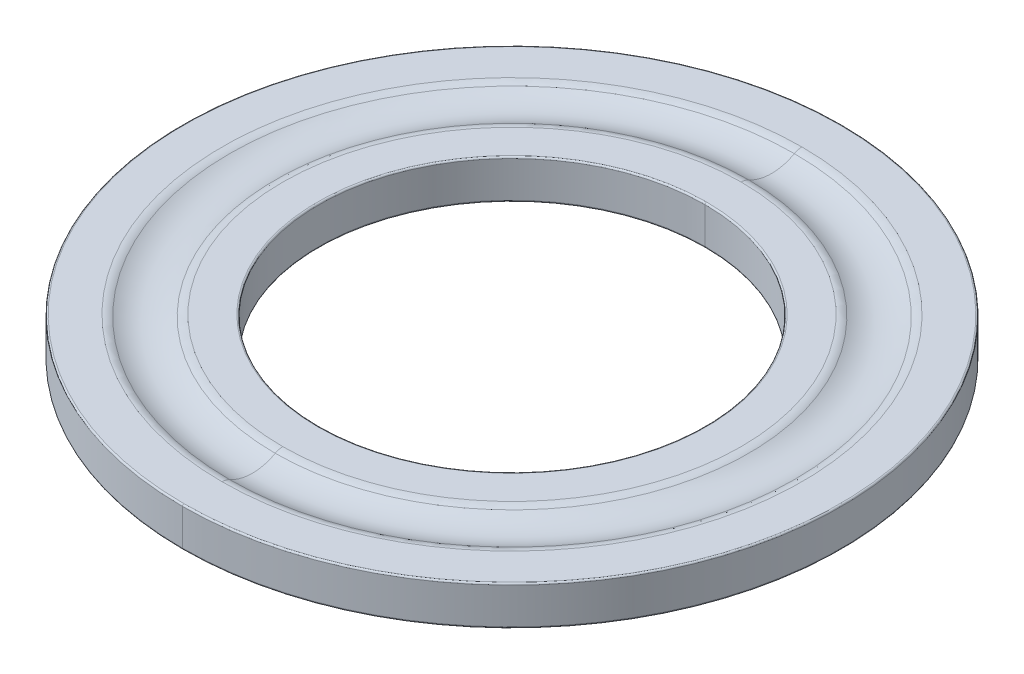
ISO-10303-21;
HEADER;
FILE_DESCRIPTION(('STEP AP214'),'2;1');
FILE_NAME('part.step','',(''),(''),'','','');
FILE_SCHEMA(('AUTOMOTIVE_DESIGN { 1 0 10303 214 1 1 1 1 }'));
ENDSEC;
DATA;
#1=APPLICATION_CONTEXT('core data for automotive mechanical design processes');
#2=APPLICATION_PROTOCOL_DEFINITION('international standard','automotive_design',2000,#1);
#3=PRODUCT_CONTEXT('',#1,'mechanical');
#4=PRODUCT('Part','Part','',(#3));
#5=PRODUCT_RELATED_PRODUCT_CATEGORY('part','',(#4));
#6=PRODUCT_DEFINITION_FORMATION('','',#4);
#7=PRODUCT_DEFINITION_CONTEXT('part definition',#1,'design');
#8=PRODUCT_DEFINITION('design','',#6,#7);
#9=PRODUCT_DEFINITION_SHAPE('','',#8);
#10=(LENGTH_UNIT() NAMED_UNIT(*) SI_UNIT(.MILLI.,.METRE.));
#11=(NAMED_UNIT(*) PLANE_ANGLE_UNIT() SI_UNIT($,.RADIAN.));
#12=(NAMED_UNIT(*) SI_UNIT($,.STERADIAN.) SOLID_ANGLE_UNIT());
#13=UNCERTAINTY_MEASURE_WITH_UNIT(LENGTH_MEASURE(1.E-05),#10,'distance_accuracy_value','');
#14=(GEOMETRIC_REPRESENTATION_CONTEXT(3) GLOBAL_UNCERTAINTY_ASSIGNED_CONTEXT((#13)) GLOBAL_UNIT_ASSIGNED_CONTEXT((#10,
#11,#12)) REPRESENTATION_CONTEXT('',''));
#15=CARTESIAN_POINT('',(0.,0.,0.));
#16=DIRECTION('',(0.,0.,1.));
#17=DIRECTION('',(1.,0.,0.));
#18=AXIS2_PLACEMENT_3D('',#15,#16,#17);
#19=CARTESIAN_POINT('',(0.,1.2,0.));
#20=DIRECTION('',(0.,1.,0.));
#21=DIRECTION('',(0.,0.,1.));
#22=AXIS2_PLACEMENT_3D('',#19,#20,#21);
#23=TOROIDAL_SURFACE('',#22,10.45,0.05);
#24=CARTESIAN_POINT('',(0.,1.2,-10.45));
#25=DIRECTION('',(1.,0.,0.));
#26=DIRECTION('',(0.,0.,-1.));
#27=AXIS2_PLACEMENT_3D('',#24,#25,#26);
#28=CIRCLE('',#27,0.05);
#29=CARTESIAN_POINT('',(0.,1.2,-10.5));
#30=VERTEX_POINT('',#29);
#31=CARTESIAN_POINT('',(0.,1.25,-10.45));
#32=VERTEX_POINT('',#31);
#33=EDGE_CURVE('E274',#30,#32,#28,.T.);
#34=ORIENTED_EDGE('',*,*,#33,.F.);
#35=CARTESIAN_POINT('',(0.,1.2,0.));
#36=DIRECTION('',(0.,-1.,0.));
#37=DIRECTION('',(0.,0.,1.));
#38=AXIS2_PLACEMENT_3D('',#35,#36,#37);
#39=CIRCLE('',#38,10.5);
#40=CARTESIAN_POINT('',(0.,1.2,10.5));
#41=VERTEX_POINT('',#40);
#42=EDGE_CURVE('E25',#41,#30,#39,.T.);
#43=ORIENTED_EDGE('',*,*,#42,.F.);
#44=CARTESIAN_POINT('',(0.,1.2,10.45));
#45=DIRECTION('',(-1.,0.,0.));
#46=DIRECTION('',(0.,0.,1.));
#47=AXIS2_PLACEMENT_3D('',#44,#45,#46);
#48=CIRCLE('',#47,0.05);
#49=CARTESIAN_POINT('',(0.,1.25,10.45));
#50=VERTEX_POINT('',#49);
#51=EDGE_CURVE('E282',#41,#50,#48,.T.);
#52=ORIENTED_EDGE('',*,*,#51,.T.);
#53=CARTESIAN_POINT('',(0.,1.25,0.));
#54=DIRECTION('',(0.,1.,0.));
#55=DIRECTION('',(0.,0.,1.));
#56=AXIS2_PLACEMENT_3D('',#53,#54,#55);
#57=CIRCLE('',#56,10.45);
#58=EDGE_CURVE('E245',#32,#50,#57,.T.);
#59=ORIENTED_EDGE('',*,*,#58,.F.);
#60=EDGE_LOOP('',(#34,#43,#52,#59));
#61=FACE_BOUND('',#60,.T.);
#62=ADVANCED_FACE('F16',(#61),#23,.T.);
#63=CARTESIAN_POINT('',(0.,0.05,0.));
#64=DIRECTION('',(0.,1.,0.));
#65=DIRECTION('',(0.,0.,1.));
#66=AXIS2_PLACEMENT_3D('',#63,#64,#65);
#67=TOROIDAL_SURFACE('',#66,10.45,0.05);
#68=CARTESIAN_POINT('',(0.,0.05,-10.45));
#69=DIRECTION('',(1.,0.,0.));
#70=DIRECTION('',(0.,0.,-1.));
#71=AXIS2_PLACEMENT_3D('',#68,#69,#70);
#72=CIRCLE('',#71,0.05);
#73=CARTESIAN_POINT('',(0.,0.,-10.45));
#74=VERTEX_POINT('',#73);
#75=CARTESIAN_POINT('',(0.,0.05,-10.5));
#76=VERTEX_POINT('',#75);
#77=EDGE_CURVE('E296',#74,#76,#72,.T.);
#78=ORIENTED_EDGE('',*,*,#77,.F.);
#79=CARTESIAN_POINT('',(0.,0.,0.));
#80=DIRECTION('',(0.,-1.,0.));
#81=DIRECTION('',(0.,0.,1.));
#82=AXIS2_PLACEMENT_3D('',#79,#80,#81);
#83=CIRCLE('',#82,10.45);
#84=CARTESIAN_POINT('',(0.,0.,10.45));
#85=VERTEX_POINT('',#84);
#86=EDGE_CURVE('E235',#85,#74,#83,.T.);
#87=ORIENTED_EDGE('',*,*,#86,.F.);
#88=CARTESIAN_POINT('',(0.,0.05,10.45));
#89=DIRECTION('',(-1.,0.,0.));
#90=DIRECTION('',(0.,0.,1.));
#91=AXIS2_PLACEMENT_3D('',#88,#89,#90);
#92=CIRCLE('',#91,0.05);
#93=CARTESIAN_POINT('',(0.,0.05,10.5));
#94=VERTEX_POINT('',#93);
#95=EDGE_CURVE('E179',#85,#94,#92,.T.);
#96=ORIENTED_EDGE('',*,*,#95,.T.);
#97=CARTESIAN_POINT('',(0.,0.05,0.));
#98=DIRECTION('',(0.,1.,0.));
#99=DIRECTION('',(0.,0.,1.));
#100=AXIS2_PLACEMENT_3D('',#97,#98,#99);
#101=CIRCLE('',#100,10.5);
#102=EDGE_CURVE('E10',#76,#94,#101,.T.);
#103=ORIENTED_EDGE('',*,*,#102,.F.);
#104=EDGE_LOOP('',(#78,#87,#96,#103));
#105=FACE_BOUND('',#104,.T.);
#106=ADVANCED_FACE('F18',(#105),#67,.T.);
#107=CARTESIAN_POINT('',(0.,1.2,0.));
#108=DIRECTION('',(0.,1.,0.));
#109=DIRECTION('',(0.,0.,1.));
#110=AXIS2_PLACEMENT_3D('',#107,#108,#109);
#111=TOROIDAL_SURFACE('',#110,6.2,0.05);
#112=CARTESIAN_POINT('',(0.,1.2,-6.2));
#113=DIRECTION('',(1.,0.,0.));
#114=DIRECTION('',(0.,0.,-1.));
#115=AXIS2_PLACEMENT_3D('',#112,#113,#114);
#116=CIRCLE('',#115,0.05);
#117=CARTESIAN_POINT('',(0.,1.25,-6.2));
#118=VERTEX_POINT('',#117);
#119=CARTESIAN_POINT('',(0.,1.2,-6.15));
#120=VERTEX_POINT('',#119);
#121=EDGE_CURVE('E158',#118,#120,#116,.T.);
#122=ORIENTED_EDGE('',*,*,#121,.F.);
#123=CARTESIAN_POINT('',(0.,1.25,0.));
#124=DIRECTION('',(0.,-1.,0.));
#125=DIRECTION('',(0.,0.,1.));
#126=AXIS2_PLACEMENT_3D('',#123,#124,#125);
#127=CIRCLE('',#126,6.2);
#128=CARTESIAN_POINT('',(0.,1.25,6.2));
#129=VERTEX_POINT('',#128);
#130=EDGE_CURVE('E220',#129,#118,#127,.T.);
#131=ORIENTED_EDGE('',*,*,#130,.F.);
#132=CARTESIAN_POINT('',(0.,1.2,6.2));
#133=DIRECTION('',(-1.,0.,0.));
#134=DIRECTION('',(0.,0.,1.));
#135=AXIS2_PLACEMENT_3D('',#132,#133,#134);
#136=CIRCLE('',#135,0.05);
#137=CARTESIAN_POINT('',(0.,1.2,6.15));
#138=VERTEX_POINT('',#137);
#139=EDGE_CURVE('E161',#129,#138,#136,.T.);
#140=ORIENTED_EDGE('',*,*,#139,.T.);
#141=CARTESIAN_POINT('',(0.,1.2,0.));
#142=DIRECTION('',(0.,1.,0.));
#143=DIRECTION('',(0.,0.,1.));
#144=AXIS2_PLACEMENT_3D('',#141,#142,#143);
#145=CIRCLE('',#144,6.15);
#146=EDGE_CURVE('E144',#120,#138,#145,.T.);
#147=ORIENTED_EDGE('',*,*,#146,.F.);
#148=EDGE_LOOP('',(#122,#131,#140,#147));
#149=FACE_BOUND('',#148,.T.);
#150=ADVANCED_FACE('F156',(#149),#111,.T.);
#151=CARTESIAN_POINT('',(0.,0.05,0.));
#152=DIRECTION('',(0.,1.,0.));
#153=DIRECTION('',(0.,0.,1.));
#154=AXIS2_PLACEMENT_3D('',#151,#152,#153);
#155=TOROIDAL_SURFACE('',#154,6.2,0.05);
#156=CARTESIAN_POINT('',(0.,0.05,-6.2));
#157=DIRECTION('',(1.,0.,0.));
#158=DIRECTION('',(0.,0.,-1.));
#159=AXIS2_PLACEMENT_3D('',#156,#157,#158);
#160=CIRCLE('',#159,0.05);
#161=CARTESIAN_POINT('',(0.,0.05,-6.15));
#162=VERTEX_POINT('',#161);
#163=CARTESIAN_POINT('',(0.,0.,-6.2));
#164=VERTEX_POINT('',#163);
#165=EDGE_CURVE('E186',#162,#164,#160,.T.);
#166=ORIENTED_EDGE('',*,*,#165,.F.);
#167=CARTESIAN_POINT('',(0.,0.05,0.));
#168=DIRECTION('',(0.,-1.,0.));
#169=DIRECTION('',(0.,0.,1.));
#170=AXIS2_PLACEMENT_3D('',#167,#168,#169);
#171=CIRCLE('',#170,6.15);
#172=CARTESIAN_POINT('',(0.,0.05,6.15));
#173=VERTEX_POINT('',#172);
#174=EDGE_CURVE('E146',#173,#162,#171,.T.);
#175=ORIENTED_EDGE('',*,*,#174,.F.);
#176=CARTESIAN_POINT('',(0.,0.05,6.2));
#177=DIRECTION('',(-1.,0.,0.));
#178=DIRECTION('',(0.,0.,1.));
#179=AXIS2_PLACEMENT_3D('',#176,#177,#178);
#180=CIRCLE('',#179,0.05);
#181=CARTESIAN_POINT('',(0.,0.,6.2));
#182=VERTEX_POINT('',#181);
#183=EDGE_CURVE('E196',#173,#182,#180,.T.);
#184=ORIENTED_EDGE('',*,*,#183,.T.);
#185=CARTESIAN_POINT('',(0.,0.,0.));
#186=DIRECTION('',(0.,1.,0.));
#187=DIRECTION('',(0.,0.,1.));
#188=AXIS2_PLACEMENT_3D('',#185,#186,#187);
#189=CIRCLE('',#188,6.2);
#190=EDGE_CURVE('E252',#164,#182,#189,.T.);
#191=ORIENTED_EDGE('',*,*,#190,.F.);
#192=EDGE_LOOP('',(#166,#175,#184,#191));
#193=FACE_BOUND('',#192,.T.);
#194=ADVANCED_FACE('F640',(#193),#155,.T.);
#195=CARTESIAN_POINT('',(0.,0.75,0.));
#196=DIRECTION('',(0.,1.,0.));
#197=DIRECTION('',(0.,0.,1.));
#198=AXIS2_PLACEMENT_3D('',#195,#196,#197);
#199=TOROIDAL_SURFACE('',#198,9.23824583655185,0.5);
#200=CARTESIAN_POINT('',(0.,0.75,-9.23824583655185));
#201=DIRECTION('',(1.,0.,0.));
#202=DIRECTION('',(0.,0.,-1.));
#203=AXIS2_PLACEMENT_3D('',#200,#201,#202);
#204=CIRCLE('',#203,0.5);
#205=CARTESIAN_POINT('',(0.,1.25,-9.23824583655185));
#206=VERTEX_POINT('',#205);
#207=CARTESIAN_POINT('',(0.,1.18749999999994,-8.99618437741385));
#208=VERTEX_POINT('',#207);
#209=EDGE_CURVE('E195',#206,#208,#204,.T.);
#210=ORIENTED_EDGE('',*,*,#209,.F.);
#211=CARTESIAN_POINT('',(0.,1.25,0.));
#212=DIRECTION('',(0.,-1.,0.));
#213=DIRECTION('',(0.,0.,1.));
#214=AXIS2_PLACEMENT_3D('',#211,#212,#213);
#215=CIRCLE('',#214,9.23824583655185);
#216=CARTESIAN_POINT('',(0.,1.25,9.23824583655185));
#217=VERTEX_POINT('',#216);
#218=EDGE_CURVE('E221',#217,#206,#215,.T.);
#219=ORIENTED_EDGE('',*,*,#218,.F.);
#220=CARTESIAN_POINT('',(0.,0.75,9.23824583655185));
#221=DIRECTION('',(-1.,0.,0.));
#222=DIRECTION('',(0.,0.,1.));
#223=AXIS2_PLACEMENT_3D('',#220,#221,#222);
#224=CIRCLE('',#223,0.5);
#225=CARTESIAN_POINT('',(0.,1.18749999999994,8.99618437741385));
#226=VERTEX_POINT('',#225);
#227=EDGE_CURVE('E201',#217,#226,#224,.T.);
#228=ORIENTED_EDGE('',*,*,#227,.T.);
#229=CARTESIAN_POINT('',(0.,1.18749999999994,0.));
#230=DIRECTION('',(0.,1.,0.));
#231=DIRECTION('',(0.,0.,1.));
#232=AXIS2_PLACEMENT_3D('',#229,#230,#231);
#233=CIRCLE('',#232,8.99618437741392);
#234=EDGE_CURVE('E224',#208,#226,#233,.T.);
#235=ORIENTED_EDGE('',*,*,#234,.F.);
#236=EDGE_LOOP('',(#210,#219,#228,#235));
#237=FACE_BOUND('',#236,.T.);
#238=ADVANCED_FACE('F380',(#237),#199,.T.);
#239=CARTESIAN_POINT('',(0.,0.75,0.));
#240=DIRECTION('',(0.,-1.,0.));
#241=DIRECTION('',(0.,0.,-1.));
#242=AXIS2_PLACEMENT_3D('',#239,#240,#241);
#243=TOROIDAL_SURFACE('',#242,7.30175416344815,0.5);
#244=CARTESIAN_POINT('',(0.,0.75,7.30175416344815));
#245=DIRECTION('',(1.,0.,0.));
#246=DIRECTION('',(0.,0.,-1.));
#247=AXIS2_PLACEMENT_3D('',#244,#245,#246);
#248=CIRCLE('',#247,0.5);
#249=CARTESIAN_POINT('',(0.,1.25,7.30175416344815));
#250=VERTEX_POINT('',#249);
#251=CARTESIAN_POINT('',(0.,1.18749999999996,7.54381562258609));
#252=VERTEX_POINT('',#251);
#253=EDGE_CURVE('E209',#250,#252,#248,.T.);
#254=ORIENTED_EDGE('',*,*,#253,.F.);
#255=CARTESIAN_POINT('',(0.,1.25,0.));
#256=DIRECTION('',(0.,1.,0.));
#257=DIRECTION('',(0.,0.,1.));
#258=AXIS2_PLACEMENT_3D('',#255,#256,#257);
#259=CIRCLE('',#258,7.30175416344815);
#260=CARTESIAN_POINT('',(0.,1.25,-7.30175416344815));
#261=VERTEX_POINT('',#260);
#262=EDGE_CURVE('E217',#261,#250,#259,.T.);
#263=ORIENTED_EDGE('',*,*,#262,.F.);
#264=CARTESIAN_POINT('',(0.,0.75,-7.30175416344815));
#265=DIRECTION('',(-1.,0.,0.));
#266=DIRECTION('',(0.,0.,1.));
#267=AXIS2_PLACEMENT_3D('',#264,#265,#266);
#268=CIRCLE('',#267,0.5);
#269=CARTESIAN_POINT('',(0.,1.18749999999996,-7.54381562258609));
#270=VERTEX_POINT('',#269);
#271=EDGE_CURVE('E216',#261,#270,#268,.T.);
#272=ORIENTED_EDGE('',*,*,#271,.T.);
#273=CARTESIAN_POINT('',(0.,1.18749999999996,0.));
#274=DIRECTION('',(0.,-1.,0.));
#275=DIRECTION('',(0.,0.,1.));
#276=AXIS2_PLACEMENT_3D('',#273,#274,#275);
#277=CIRCLE('',#276,7.54381562258609);
#278=EDGE_CURVE('E48',#252,#270,#277,.T.);
#279=ORIENTED_EDGE('',*,*,#278,.F.);
#280=EDGE_LOOP('',(#254,#263,#272,#279));
#281=FACE_BOUND('',#280,.T.);
#282=ADVANCED_FACE('F618',(#281),#243,.T.);
#283=CARTESIAN_POINT('',(0.,2.5,0.));
#284=DIRECTION('',(0.,-1.,0.));
#285=DIRECTION('',(0.,0.,-1.));
#286=AXIS2_PLACEMENT_3D('',#283,#284,#285);
#287=TOROIDAL_SURFACE('',#286,8.27,1.5);
#288=CARTESIAN_POINT('',(0.,2.5,8.27));
#289=DIRECTION('',(1.,0.,0.));
#290=DIRECTION('',(0.,0.,-1.));
#291=AXIS2_PLACEMENT_3D('',#288,#289,#290);
#292=CIRCLE('',#291,1.5);
#293=EDGE_CURVE('E228',#226,#252,#292,.T.);
#294=ORIENTED_EDGE('',*,*,#293,.F.);
#295=CARTESIAN_POINT('',(0.,1.18749999999994,0.));
#296=DIRECTION('',(0.,1.,0.));
#297=DIRECTION('',(0.,0.,1.));
#298=AXIS2_PLACEMENT_3D('',#295,#296,#297);
#299=CIRCLE('',#298,8.99618437741392);
#300=EDGE_CURVE('E200',#226,#208,#299,.T.);
#301=ORIENTED_EDGE('',*,*,#300,.T.);
#302=CARTESIAN_POINT('',(0.,2.5,-8.27));
#303=DIRECTION('',(-1.,0.,0.));
#304=DIRECTION('',(0.,0.,1.));
#305=AXIS2_PLACEMENT_3D('',#302,#303,#304);
#306=CIRCLE('',#305,1.5);
#307=EDGE_CURVE('E38',#208,#270,#306,.T.);
#308=ORIENTED_EDGE('',*,*,#307,.T.);
#309=CARTESIAN_POINT('',(0.,1.18749999999996,0.));
#310=DIRECTION('',(0.,-1.,0.));
#311=DIRECTION('',(0.,0.,1.));
#312=AXIS2_PLACEMENT_3D('',#309,#310,#311);
#313=CIRCLE('',#312,7.54381562258609);
#314=EDGE_CURVE('E213',#270,#252,#313,.T.);
#315=ORIENTED_EDGE('',*,*,#314,.T.);
#316=EDGE_LOOP('',(#294,#301,#308,#315));
#317=FACE_BOUND('',#316,.T.);
#318=ADVANCED_FACE('F367',(#317),#287,.F.);
#319=CARTESIAN_POINT('',(0.,1.25,0.));
#320=DIRECTION('',(0.,-1.,0.));
#321=DIRECTION('',(0.,0.,-1.));
#322=AXIS2_PLACEMENT_3D('',#319,#320,#321);
#323=CYLINDRICAL_SURFACE('',#322,6.15);
#324=DIRECTION('',(0.,-1.,0.));
#325=VECTOR('',#324,1.);
#326=CARTESIAN_POINT('',(0.,1.25,6.15));
#327=LINE('',#326,#325);
#328=EDGE_CURVE('E164',#138,#173,#327,.T.);
#329=ORIENTED_EDGE('',*,*,#328,.F.);
#330=CARTESIAN_POINT('',(0.,1.2,0.));
#331=DIRECTION('',(0.,1.,0.));
#332=DIRECTION('',(0.,0.,1.));
#333=AXIS2_PLACEMENT_3D('',#330,#331,#332);
#334=CIRCLE('',#333,6.15);
#335=EDGE_CURVE('E166',#138,#120,#334,.T.);
#336=ORIENTED_EDGE('',*,*,#335,.T.);
#337=DIRECTION('',(0.,-1.,0.));
#338=VECTOR('',#337,1.);
#339=CARTESIAN_POINT('',(0.,1.25,-6.15));
#340=LINE('',#339,#338);
#341=EDGE_CURVE('E140',#120,#162,#340,.T.);
#342=ORIENTED_EDGE('',*,*,#341,.T.);
#343=CARTESIAN_POINT('',(0.,0.05,0.));
#344=DIRECTION('',(0.,-1.,0.));
#345=DIRECTION('',(0.,0.,1.));
#346=AXIS2_PLACEMENT_3D('',#343,#344,#345);
#347=CIRCLE('',#346,6.15);
#348=EDGE_CURVE('E185',#162,#173,#347,.T.);
#349=ORIENTED_EDGE('',*,*,#348,.T.);
#350=EDGE_LOOP('',(#329,#336,#342,#349));
#351=FACE_BOUND('',#350,.T.);
#352=ADVANCED_FACE('F167',(#351),#323,.F.);
#353=CARTESIAN_POINT('',(0.,1.25,0.));
#354=DIRECTION('',(0.,-1.,0.));
#355=DIRECTION('',(0.,0.,-1.));
#356=AXIS2_PLACEMENT_3D('',#353,#354,#355);
#357=CYLINDRICAL_SURFACE('',#356,10.5);
#358=DIRECTION('',(0.,-1.,0.));
#359=VECTOR('',#358,1.);
#360=CARTESIAN_POINT('',(0.,1.25,10.5));
#361=LINE('',#360,#359);
#362=EDGE_CURVE('E152',#41,#94,#361,.T.);
#363=ORIENTED_EDGE('',*,*,#362,.F.);
#364=ORIENTED_EDGE('',*,*,#42,.T.);
#365=DIRECTION('',(0.,-1.,0.));
#366=VECTOR('',#365,1.);
#367=CARTESIAN_POINT('',(0.,1.25,-10.5));
#368=LINE('',#367,#366);
#369=EDGE_CURVE('E241',#30,#76,#368,.T.);
#370=ORIENTED_EDGE('',*,*,#369,.T.);
#371=ORIENTED_EDGE('',*,*,#102,.T.);
#372=EDGE_LOOP('',(#363,#364,#370,#371));
#373=FACE_BOUND('',#372,.T.);
#374=ADVANCED_FACE('F259',(#373),#357,.T.);
#375=CARTESIAN_POINT('',(0.,0.,0.));
#376=DIRECTION('',(0.,1.,0.));
#377=DIRECTION('',(1.,0.,0.));
#378=AXIS2_PLACEMENT_3D('',#375,#376,#377);
#379=PLANE('',#378);
#380=CARTESIAN_POINT('',(0.,0.,0.));
#381=DIRECTION('',(0.,1.,0.));
#382=DIRECTION('',(0.,0.,1.));
#383=AXIS2_PLACEMENT_3D('',#380,#381,#382);
#384=CIRCLE('',#383,6.2);
#385=EDGE_CURVE('E190',#182,#164,#384,.T.);
#386=ORIENTED_EDGE('',*,*,#385,.T.);
#387=ORIENTED_EDGE('',*,*,#190,.T.);
#388=EDGE_LOOP('',(#386,#387));
#389=FACE_BOUND('',#388,.T.);
#390=ORIENTED_EDGE('',*,*,#86,.T.);
#391=CARTESIAN_POINT('',(0.,0.,0.));
#392=DIRECTION('',(0.,-1.,0.));
#393=DIRECTION('',(0.,0.,1.));
#394=AXIS2_PLACEMENT_3D('',#391,#392,#393);
#395=CIRCLE('',#394,10.45);
#396=EDGE_CURVE('E298',#74,#85,#395,.T.);
#397=ORIENTED_EDGE('',*,*,#396,.T.);
#398=EDGE_LOOP('',(#390,#397));
#399=FACE_BOUND('',#398,.T.);
#400=ADVANCED_FACE('F320',(#389,#399),#379,.F.);
#401=CARTESIAN_POINT('',(0.,1.25,0.));
#402=DIRECTION('',(0.,1.,0.));
#403=DIRECTION('',(1.,0.,0.));
#404=AXIS2_PLACEMENT_3D('',#401,#402,#403);
#405=PLANE('',#404);
#406=ORIENTED_EDGE('',*,*,#130,.T.);
#407=CARTESIAN_POINT('',(0.,1.25,0.));
#408=DIRECTION('',(0.,-1.,0.));
#409=DIRECTION('',(0.,0.,1.));
#410=AXIS2_PLACEMENT_3D('',#407,#408,#409);
#411=CIRCLE('',#410,6.2);
#412=EDGE_CURVE('E173',#118,#129,#411,.T.);
#413=ORIENTED_EDGE('',*,*,#412,.T.);
#414=EDGE_LOOP('',(#406,#413));
#415=FACE_BOUND('',#414,.T.);
#416=ORIENTED_EDGE('',*,*,#262,.T.);
#417=CARTESIAN_POINT('',(0.,1.25,0.));
#418=DIRECTION('',(0.,1.,0.));
#419=DIRECTION('',(0.,0.,1.));
#420=AXIS2_PLACEMENT_3D('',#417,#418,#419);
#421=CIRCLE('',#420,7.30175416344815);
#422=EDGE_CURVE('E205',#250,#261,#421,.T.);
#423=ORIENTED_EDGE('',*,*,#422,.T.);
#424=EDGE_LOOP('',(#416,#423));
#425=FACE_BOUND('',#424,.T.);
#426=ADVANCED_FACE('F322',(#415,#425),#405,.T.);
#427=CARTESIAN_POINT('',(0.,1.25,0.));
#428=DIRECTION('',(0.,1.,0.));
#429=DIRECTION('',(1.,0.,0.));
#430=AXIS2_PLACEMENT_3D('',#427,#428,#429);
#431=PLANE('',#430);
#432=ORIENTED_EDGE('',*,*,#218,.T.);
#433=CARTESIAN_POINT('',(0.,1.25,0.));
#434=DIRECTION('',(0.,-1.,0.));
#435=DIRECTION('',(0.,0.,1.));
#436=AXIS2_PLACEMENT_3D('',#433,#434,#435);
#437=CIRCLE('',#436,9.23824583655185);
#438=EDGE_CURVE('E191',#206,#217,#437,.T.);
#439=ORIENTED_EDGE('',*,*,#438,.T.);
#440=EDGE_LOOP('',(#432,#439));
#441=FACE_BOUND('',#440,.T.);
#442=CARTESIAN_POINT('',(0.,1.25,0.));
#443=DIRECTION('',(0.,1.,0.));
#444=DIRECTION('',(0.,0.,1.));
#445=AXIS2_PLACEMENT_3D('',#442,#443,#444);
#446=CIRCLE('',#445,10.45);
#447=EDGE_CURVE('E279',#50,#32,#446,.T.);
#448=ORIENTED_EDGE('',*,*,#447,.T.);
#449=ORIENTED_EDGE('',*,*,#58,.T.);
#450=EDGE_LOOP('',(#448,#449));
#451=FACE_BOUND('',#450,.T.);
#452=ADVANCED_FACE('F330',(#441,#451),#431,.T.);
#453=CARTESIAN_POINT('',(0.,1.25,0.));
#454=DIRECTION('',(0.,-1.,0.));
#455=DIRECTION('',(0.,0.,-1.));
#456=AXIS2_PLACEMENT_3D('',#453,#454,#455);
#457=CYLINDRICAL_SURFACE('',#456,10.5);
#458=CARTESIAN_POINT('',(0.,1.2,0.));
#459=DIRECTION('',(0.,-1.,0.));
#460=DIRECTION('',(0.,0.,1.));
#461=AXIS2_PLACEMENT_3D('',#458,#459,#460);
#462=CIRCLE('',#461,10.5);
#463=EDGE_CURVE('E269',#30,#41,#462,.T.);
#464=ORIENTED_EDGE('',*,*,#463,.T.);
#465=ORIENTED_EDGE('',*,*,#362,.T.);
#466=CARTESIAN_POINT('',(0.,0.05,0.));
#467=DIRECTION('',(0.,1.,0.));
#468=DIRECTION('',(0.,0.,1.));
#469=AXIS2_PLACEMENT_3D('',#466,#467,#468);
#470=CIRCLE('',#469,10.5);
#471=EDGE_CURVE('E271',#94,#76,#470,.T.);
#472=ORIENTED_EDGE('',*,*,#471,.T.);
#473=ORIENTED_EDGE('',*,*,#369,.F.);
#474=EDGE_LOOP('',(#464,#465,#472,#473));
#475=FACE_BOUND('',#474,.T.);
#476=ADVANCED_FACE('F267',(#475),#457,.T.);
#477=CARTESIAN_POINT('',(0.,1.25,0.));
#478=DIRECTION('',(0.,-1.,0.));
#479=DIRECTION('',(0.,0.,-1.));
#480=AXIS2_PLACEMENT_3D('',#477,#478,#479);
#481=CYLINDRICAL_SURFACE('',#480,6.15);
#482=ORIENTED_EDGE('',*,*,#146,.T.);
#483=ORIENTED_EDGE('',*,*,#328,.T.);
#484=ORIENTED_EDGE('',*,*,#174,.T.);
#485=ORIENTED_EDGE('',*,*,#341,.F.);
#486=EDGE_LOOP('',(#482,#483,#484,#485));
#487=FACE_BOUND('',#486,.T.);
#488=ADVANCED_FACE('F142',(#487),#481,.F.);
#489=CARTESIAN_POINT('',(0.,2.5,0.));
#490=DIRECTION('',(0.,-1.,0.));
#491=DIRECTION('',(0.,0.,-1.));
#492=AXIS2_PLACEMENT_3D('',#489,#490,#491);
#493=TOROIDAL_SURFACE('',#492,8.27,1.5);
#494=ORIENTED_EDGE('',*,*,#234,.T.);
#495=ORIENTED_EDGE('',*,*,#293,.T.);
#496=ORIENTED_EDGE('',*,*,#278,.T.);
#497=ORIENTED_EDGE('',*,*,#307,.F.);
#498=EDGE_LOOP('',(#494,#495,#496,#497));
#499=FACE_BOUND('',#498,.T.);
#500=ADVANCED_FACE('F347',(#499),#493,.F.);
#501=CARTESIAN_POINT('',(0.,0.75,0.));
#502=DIRECTION('',(0.,-1.,0.));
#503=DIRECTION('',(0.,0.,-1.));
#504=AXIS2_PLACEMENT_3D('',#501,#502,#503);
#505=TOROIDAL_SURFACE('',#504,7.30175416344815,0.5);
#506=ORIENTED_EDGE('',*,*,#422,.F.);
#507=ORIENTED_EDGE('',*,*,#253,.T.);
#508=ORIENTED_EDGE('',*,*,#314,.F.);
#509=ORIENTED_EDGE('',*,*,#271,.F.);
#510=EDGE_LOOP('',(#506,#507,#508,#509));
#511=FACE_BOUND('',#510,.T.);
#512=ADVANCED_FACE('F353',(#511),#505,.T.);
#513=CARTESIAN_POINT('',(0.,0.75,0.));
#514=DIRECTION('',(0.,1.,0.));
#515=DIRECTION('',(0.,0.,1.));
#516=AXIS2_PLACEMENT_3D('',#513,#514,#515);
#517=TOROIDAL_SURFACE('',#516,9.23824583655185,0.5);
#518=ORIENTED_EDGE('',*,*,#438,.F.);
#519=ORIENTED_EDGE('',*,*,#209,.T.);
#520=ORIENTED_EDGE('',*,*,#300,.F.);
#521=ORIENTED_EDGE('',*,*,#227,.F.);
#522=EDGE_LOOP('',(#518,#519,#520,#521));
#523=FACE_BOUND('',#522,.T.);
#524=ADVANCED_FACE('F357',(#523),#517,.T.);
#525=CARTESIAN_POINT('',(0.,0.05,0.));
#526=DIRECTION('',(0.,1.,0.));
#527=DIRECTION('',(0.,0.,1.));
#528=AXIS2_PLACEMENT_3D('',#525,#526,#527);
#529=TOROIDAL_SURFACE('',#528,6.2,0.05);
#530=ORIENTED_EDGE('',*,*,#348,.F.);
#531=ORIENTED_EDGE('',*,*,#165,.T.);
#532=ORIENTED_EDGE('',*,*,#385,.F.);
#533=ORIENTED_EDGE('',*,*,#183,.F.);
#534=EDGE_LOOP('',(#530,#531,#532,#533));
#535=FACE_BOUND('',#534,.T.);
#536=ADVANCED_FACE('F350',(#535),#529,.T.);
#537=CARTESIAN_POINT('',(0.,1.2,0.));
#538=DIRECTION('',(0.,1.,0.));
#539=DIRECTION('',(0.,0.,1.));
#540=AXIS2_PLACEMENT_3D('',#537,#538,#539);
#541=TOROIDAL_SURFACE('',#540,6.2,0.05);
#542=ORIENTED_EDGE('',*,*,#412,.F.);
#543=ORIENTED_EDGE('',*,*,#121,.T.);
#544=ORIENTED_EDGE('',*,*,#335,.F.);
#545=ORIENTED_EDGE('',*,*,#139,.F.);
#546=EDGE_LOOP('',(#542,#543,#544,#545));
#547=FACE_BOUND('',#546,.T.);
#548=ADVANCED_FACE('F171',(#547),#541,.T.);
#549=CARTESIAN_POINT('',(0.,0.05,0.));
#550=DIRECTION('',(0.,1.,0.));
#551=DIRECTION('',(0.,0.,1.));
#552=AXIS2_PLACEMENT_3D('',#549,#550,#551);
#553=TOROIDAL_SURFACE('',#552,10.45,0.05);
#554=ORIENTED_EDGE('',*,*,#396,.F.);
#555=ORIENTED_EDGE('',*,*,#77,.T.);
#556=ORIENTED_EDGE('',*,*,#471,.F.);
#557=ORIENTED_EDGE('',*,*,#95,.F.);
#558=EDGE_LOOP('',(#554,#555,#556,#557));
#559=FACE_BOUND('',#558,.T.);
#560=ADVANCED_FACE('F318',(#559),#553,.T.);
#561=CARTESIAN_POINT('',(0.,1.2,0.));
#562=DIRECTION('',(0.,1.,0.));
#563=DIRECTION('',(0.,0.,1.));
#564=AXIS2_PLACEMENT_3D('',#561,#562,#563);
#565=TOROIDAL_SURFACE('',#564,10.45,0.05);
#566=ORIENTED_EDGE('',*,*,#463,.F.);
#567=ORIENTED_EDGE('',*,*,#33,.T.);
#568=ORIENTED_EDGE('',*,*,#447,.F.);
#569=ORIENTED_EDGE('',*,*,#51,.F.);
#570=EDGE_LOOP('',(#566,#567,#568,#569));
#571=FACE_BOUND('',#570,.T.);
#572=ADVANCED_FACE('F281',(#571),#565,.T.);
#573=CLOSED_SHELL('',(#62,#106,#150,#194,#238,#282,#318,#352,#374,#400,#426,#452,#476,#488,#500,
#512,#524,#536,#548,#560,#572));
#574=MANIFOLD_SOLID_BREP('B1',#573);
#575=ADVANCED_BREP_SHAPE_REPRESENTATION('',(#18,#574),#14);
#576=SHAPE_DEFINITION_REPRESENTATION(#9,#575);
ENDSEC;
END-ISO-10303-21;
